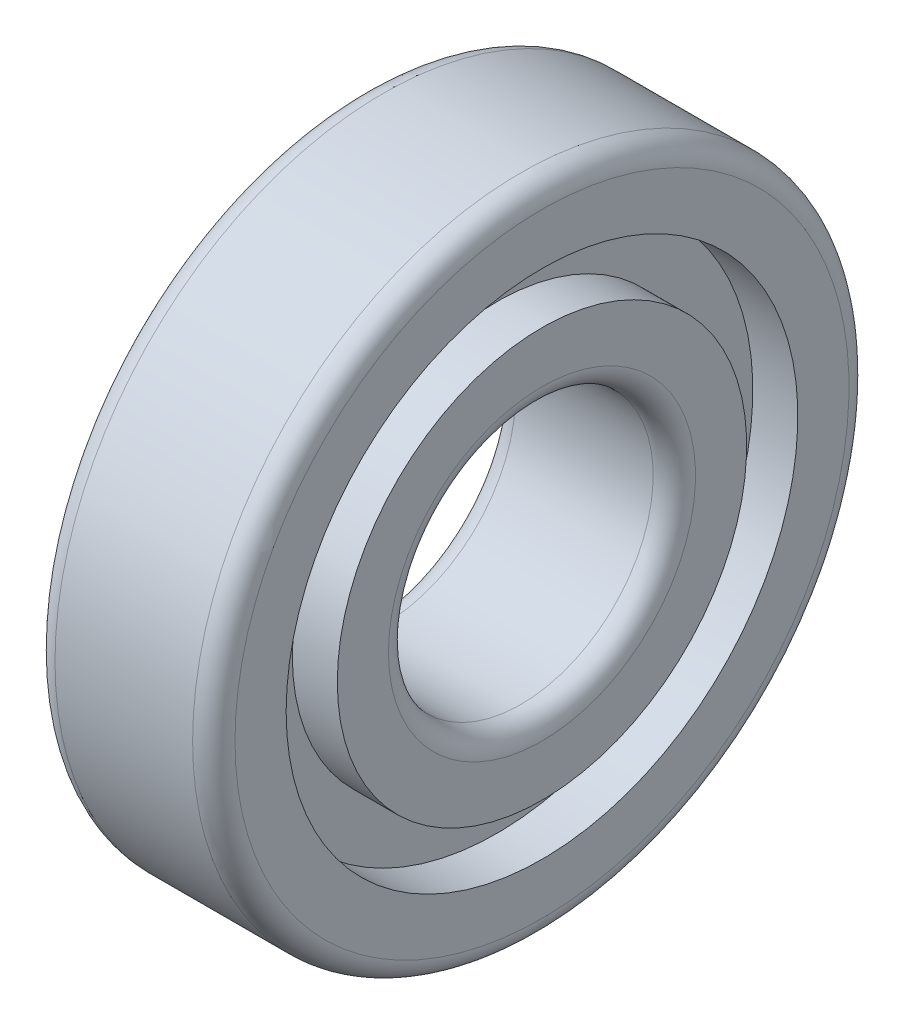
ISO-10303-21;
HEADER;
FILE_DESCRIPTION(('STEP AP214'),'2;1');
FILE_NAME('part.step','',(''),(''),'','','');
FILE_SCHEMA(('AUTOMOTIVE_DESIGN { 1 0 10303 214 1 1 1 1 }'));
ENDSEC;
DATA;
#1=APPLICATION_CONTEXT('core data for automotive mechanical design processes');
#2=APPLICATION_PROTOCOL_DEFINITION('international standard','automotive_design',2000,#1);
#3=PRODUCT_CONTEXT('',#1,'mechanical');
#4=PRODUCT('Part','Part','',(#3));
#5=PRODUCT_RELATED_PRODUCT_CATEGORY('part','',(#4));
#6=PRODUCT_DEFINITION_FORMATION('','',#4);
#7=PRODUCT_DEFINITION_CONTEXT('part definition',#1,'design');
#8=PRODUCT_DEFINITION('design','',#6,#7);
#9=PRODUCT_DEFINITION_SHAPE('','',#8);
#10=(LENGTH_UNIT() NAMED_UNIT(*) SI_UNIT(.MILLI.,.METRE.));
#11=(NAMED_UNIT(*) PLANE_ANGLE_UNIT() SI_UNIT($,.RADIAN.));
#12=(NAMED_UNIT(*) SI_UNIT($,.STERADIAN.) SOLID_ANGLE_UNIT());
#13=UNCERTAINTY_MEASURE_WITH_UNIT(LENGTH_MEASURE(1.E-05),#10,'distance_accuracy_value','');
#14=(GEOMETRIC_REPRESENTATION_CONTEXT(3) GLOBAL_UNCERTAINTY_ASSIGNED_CONTEXT((#13)) GLOBAL_UNIT_ASSIGNED_CONTEXT((#10,
#11,#12)) REPRESENTATION_CONTEXT('',''));
#15=CARTESIAN_POINT('',(0.,0.,0.));
#16=DIRECTION('',(0.,0.,1.));
#17=DIRECTION('',(1.,0.,0.));
#18=AXIS2_PLACEMENT_3D('',#15,#16,#17);
#19=CARTESIAN_POINT('',(-873.991742101089,0.,0.));
#20=DIRECTION('',(-1.,0.,0.));
#21=DIRECTION('',(0.,0.,1.));
#22=AXIS2_PLACEMENT_3D('',#19,#20,#21);
#23=CYLINDRICAL_SURFACE('',#22,19.3333333333333);
#24=CARTESIAN_POINT('',(-8.49999999999995,0.,0.));
#25=DIRECTION('',(-1.,0.,0.));
#26=DIRECTION('',(0.,0.,1.));
#27=AXIS2_PLACEMENT_3D('',#24,#25,#26);
#28=CIRCLE('',#27,19.3333333333333);
#29=CARTESIAN_POINT('',(-8.49999999999995,0.,19.3333333333333));
#30=VERTEX_POINT('',#29);
#31=EDGE_CURVE('E104',#30,#30,#28,.T.);
#32=ORIENTED_EDGE('',*,*,#31,.F.);
#33=EDGE_LOOP('',(#32));
#34=FACE_BOUND('',#33,.T.);
#35=CARTESIAN_POINT('',(-4.24999999999998,0.,0.));
#36=DIRECTION('',(-1.,0.,0.));
#37=DIRECTION('',(0.,0.,1.));
#38=AXIS2_PLACEMENT_3D('',#35,#36,#37);
#39=CIRCLE('',#38,19.3333333333333);
#40=CARTESIAN_POINT('',(-4.24999999999998,0.,19.3333333333333));
#41=VERTEX_POINT('',#40);
#42=EDGE_CURVE('E10',#41,#41,#39,.T.);
#43=ORIENTED_EDGE('',*,*,#42,.T.);
#44=EDGE_LOOP('',(#43));
#45=FACE_BOUND('',#44,.T.);
#46=ADVANCED_FACE('F37',(#34,#45),#23,.T.);
#47=CARTESIAN_POINT('',(-4.25,19.3333333333333,0.));
#48=DIRECTION('',(1.,0.,0.));
#49=DIRECTION('',(0.,0.,-1.));
#50=AXIS2_PLACEMENT_3D('',#47,#48,#49);
#51=PLANE('',#50);
#52=ORIENTED_EDGE('',*,*,#42,.F.);
#53=EDGE_LOOP('',(#52));
#54=FACE_BOUND('',#53,.T.);
#55=CARTESIAN_POINT('',(-4.24999999999998,0.,0.));
#56=DIRECTION('',(-1.,0.,0.));
#57=DIRECTION('',(0.,0.,1.));
#58=AXIS2_PLACEMENT_3D('',#55,#56,#57);
#59=CIRCLE('',#58,24.1666666666667);
#60=CARTESIAN_POINT('',(-4.24999999999998,0.,24.1666666666667));
#61=VERTEX_POINT('',#60);
#62=EDGE_CURVE('E44',#61,#61,#59,.T.);
#63=ORIENTED_EDGE('',*,*,#62,.T.);
#64=EDGE_LOOP('',(#63));
#65=FACE_BOUND('',#64,.T.);
#66=ADVANCED_FACE('F112',(#54,#65),#51,.F.);
#67=CARTESIAN_POINT('',(-873.991742101089,0.,0.));
#68=DIRECTION('',(-1.,0.,0.));
#69=DIRECTION('',(0.,0.,1.));
#70=AXIS2_PLACEMENT_3D('',#67,#68,#69);
#71=CYLINDRICAL_SURFACE('',#70,24.1666666666667);
#72=ORIENTED_EDGE('',*,*,#62,.F.);
#73=EDGE_LOOP('',(#72));
#74=FACE_BOUND('',#73,.T.);
#75=CARTESIAN_POINT('',(-8.49999999999995,0.,0.));
#76=DIRECTION('',(-1.,0.,0.));
#77=DIRECTION('',(0.,0.,1.));
#78=AXIS2_PLACEMENT_3D('',#75,#76,#77);
#79=CIRCLE('',#78,24.1666666666667);
#80=CARTESIAN_POINT('',(-8.49999999999995,0.,24.1666666666667));
#81=VERTEX_POINT('',#80);
#82=EDGE_CURVE('E49',#81,#81,#79,.T.);
#83=ORIENTED_EDGE('',*,*,#82,.T.);
#84=EDGE_LOOP('',(#83));
#85=FACE_BOUND('',#84,.T.);
#86=ADVANCED_FACE('F116',(#74,#85),#71,.F.);
#87=CARTESIAN_POINT('',(-8.5,24.1666666666667,0.));
#88=DIRECTION('',(1.,0.,0.));
#89=DIRECTION('',(0.,0.,-1.));
#90=AXIS2_PLACEMENT_3D('',#87,#88,#89);
#91=PLANE('',#90);
#92=ORIENTED_EDGE('',*,*,#82,.F.);
#93=EDGE_LOOP('',(#92));
#94=FACE_BOUND('',#93,.T.);
#95=CARTESIAN_POINT('',(-8.49999999999995,0.,0.));
#96=DIRECTION('',(-1.,0.,0.));
#97=DIRECTION('',(0.,0.,1.));
#98=AXIS2_PLACEMENT_3D('',#95,#96,#97);
#99=CIRCLE('',#98,29.);
#100=CARTESIAN_POINT('',(-8.49999999999995,0.,29.));
#101=VERTEX_POINT('',#100);
#102=EDGE_CURVE('E54',#101,#101,#99,.T.);
#103=ORIENTED_EDGE('',*,*,#102,.T.);
#104=EDGE_LOOP('',(#103));
#105=FACE_BOUND('',#104,.T.);
#106=ADVANCED_FACE('F121',(#94,#105),#91,.F.);
#107=CARTESIAN_POINT('',(-6.5,0.,0.));
#108=DIRECTION('',(-1.,0.,0.));
#109=DIRECTION('',(0.,0.,1.));
#110=AXIS2_PLACEMENT_3D('',#107,#108,#109);
#111=TOROIDAL_SURFACE('',#110,29.,2.);
#112=ORIENTED_EDGE('',*,*,#102,.F.);
#113=EDGE_LOOP('',(#112));
#114=FACE_BOUND('',#113,.T.);
#115=CARTESIAN_POINT('',(-6.49999999999995,0.,0.));
#116=DIRECTION('',(-1.,0.,0.));
#117=DIRECTION('',(0.,0.,1.));
#118=AXIS2_PLACEMENT_3D('',#115,#116,#117);
#119=CIRCLE('',#118,31.);
#120=CARTESIAN_POINT('',(-6.49999999999995,0.,31.));
#121=VERTEX_POINT('',#120);
#122=EDGE_CURVE('E60',#121,#121,#119,.T.);
#123=ORIENTED_EDGE('',*,*,#122,.T.);
#124=EDGE_LOOP('',(#123));
#125=FACE_BOUND('',#124,.T.);
#126=ADVANCED_FACE('F127',(#114,#125),#111,.T.);
#127=CARTESIAN_POINT('',(-873.991742101089,0.,0.));
#128=DIRECTION('',(-1.,0.,0.));
#129=DIRECTION('',(0.,0.,1.));
#130=AXIS2_PLACEMENT_3D('',#127,#128,#129);
#131=CYLINDRICAL_SURFACE('',#130,31.);
#132=ORIENTED_EDGE('',*,*,#122,.F.);
#133=EDGE_LOOP('',(#132));
#134=FACE_BOUND('',#133,.T.);
#135=CARTESIAN_POINT('',(6.49999999999973,0.,0.));
#136=DIRECTION('',(-1.,0.,0.));
#137=DIRECTION('',(0.,0.,1.));
#138=AXIS2_PLACEMENT_3D('',#135,#136,#137);
#139=CIRCLE('',#138,31.);
#140=CARTESIAN_POINT('',(6.49999999999973,0.,31.));
#141=VERTEX_POINT('',#140);
#142=EDGE_CURVE('E64',#141,#141,#139,.T.);
#143=ORIENTED_EDGE('',*,*,#142,.T.);
#144=EDGE_LOOP('',(#143));
#145=FACE_BOUND('',#144,.T.);
#146=ADVANCED_FACE('F131',(#134,#145),#131,.T.);
#147=CARTESIAN_POINT('',(6.4999999999998,0.,0.));
#148=DIRECTION('',(-1.,0.,0.));
#149=DIRECTION('',(0.,0.,1.));
#150=AXIS2_PLACEMENT_3D('',#147,#148,#149);
#151=TOROIDAL_SURFACE('',#150,29.,2.);
#152=ORIENTED_EDGE('',*,*,#142,.F.);
#153=EDGE_LOOP('',(#152));
#154=FACE_BOUND('',#153,.T.);
#155=CARTESIAN_POINT('',(8.49999999999984,0.,0.));
#156=DIRECTION('',(-1.,0.,0.));
#157=DIRECTION('',(0.,0.,1.));
#158=AXIS2_PLACEMENT_3D('',#155,#156,#157);
#159=CIRCLE('',#158,29.);
#160=CARTESIAN_POINT('',(8.49999999999984,0.,29.));
#161=VERTEX_POINT('',#160);
#162=EDGE_CURVE('E68',#161,#161,#159,.T.);
#163=ORIENTED_EDGE('',*,*,#162,.T.);
#164=EDGE_LOOP('',(#163));
#165=FACE_BOUND('',#164,.T.);
#166=ADVANCED_FACE('F135',(#154,#165),#151,.T.);
#167=CARTESIAN_POINT('',(8.49999999999982,24.1666666666667,0.));
#168=DIRECTION('',(-1.,0.,0.));
#169=DIRECTION('',(0.,0.,1.));
#170=AXIS2_PLACEMENT_3D('',#167,#168,#169);
#171=PLANE('',#170);
#172=ORIENTED_EDGE('',*,*,#162,.F.);
#173=EDGE_LOOP('',(#172));
#174=FACE_BOUND('',#173,.T.);
#175=CARTESIAN_POINT('',(8.49999999999984,0.,0.));
#176=DIRECTION('',(-1.,0.,0.));
#177=DIRECTION('',(0.,0.,1.));
#178=AXIS2_PLACEMENT_3D('',#175,#176,#177);
#179=CIRCLE('',#178,24.1666666666667);
#180=CARTESIAN_POINT('',(8.49999999999984,0.,24.1666666666667));
#181=VERTEX_POINT('',#180);
#182=EDGE_CURVE('E72',#181,#181,#179,.T.);
#183=ORIENTED_EDGE('',*,*,#182,.T.);
#184=EDGE_LOOP('',(#183));
#185=FACE_BOUND('',#184,.T.);
#186=ADVANCED_FACE('F139',(#174,#185),#171,.F.);
#187=CARTESIAN_POINT('',(-873.991742101089,0.,0.));
#188=DIRECTION('',(-1.,0.,0.));
#189=DIRECTION('',(0.,0.,1.));
#190=AXIS2_PLACEMENT_3D('',#187,#188,#189);
#191=CYLINDRICAL_SURFACE('',#190,24.1666666666667);
#192=ORIENTED_EDGE('',*,*,#182,.F.);
#193=EDGE_LOOP('',(#192));
#194=FACE_BOUND('',#193,.T.);
#195=CARTESIAN_POINT('',(4.24999999999986,0.,0.));
#196=DIRECTION('',(-1.,0.,0.));
#197=DIRECTION('',(0.,0.,1.));
#198=AXIS2_PLACEMENT_3D('',#195,#196,#197);
#199=CIRCLE('',#198,24.1666666666667);
#200=CARTESIAN_POINT('',(4.24999999999986,0.,24.1666666666667));
#201=VERTEX_POINT('',#200);
#202=EDGE_CURVE('E76',#201,#201,#199,.T.);
#203=ORIENTED_EDGE('',*,*,#202,.T.);
#204=EDGE_LOOP('',(#203));
#205=FACE_BOUND('',#204,.T.);
#206=ADVANCED_FACE('F143',(#194,#205),#191,.F.);
#207=CARTESIAN_POINT('',(4.24999999999985,19.3333333333333,0.));
#208=DIRECTION('',(-1.,0.,0.));
#209=DIRECTION('',(0.,0.,1.));
#210=AXIS2_PLACEMENT_3D('',#207,#208,#209);
#211=PLANE('',#210);
#212=ORIENTED_EDGE('',*,*,#202,.F.);
#213=EDGE_LOOP('',(#212));
#214=FACE_BOUND('',#213,.T.);
#215=CARTESIAN_POINT('',(4.24999999999986,0.,0.));
#216=DIRECTION('',(-1.,0.,0.));
#217=DIRECTION('',(0.,0.,1.));
#218=AXIS2_PLACEMENT_3D('',#215,#216,#217);
#219=CIRCLE('',#218,19.3333333333333);
#220=CARTESIAN_POINT('',(4.24999999999986,0.,19.3333333333333));
#221=VERTEX_POINT('',#220);
#222=EDGE_CURVE('E80',#221,#221,#219,.T.);
#223=ORIENTED_EDGE('',*,*,#222,.T.);
#224=EDGE_LOOP('',(#223));
#225=FACE_BOUND('',#224,.T.);
#226=ADVANCED_FACE('F147',(#214,#225),#211,.F.);
#227=CARTESIAN_POINT('',(-873.991742101089,0.,0.));
#228=DIRECTION('',(-1.,0.,0.));
#229=DIRECTION('',(0.,0.,1.));
#230=AXIS2_PLACEMENT_3D('',#227,#228,#229);
#231=CYLINDRICAL_SURFACE('',#230,19.3333333333333);
#232=ORIENTED_EDGE('',*,*,#222,.F.);
#233=EDGE_LOOP('',(#232));
#234=FACE_BOUND('',#233,.T.);
#235=CARTESIAN_POINT('',(8.49999999999984,0.,0.));
#236=DIRECTION('',(-1.,0.,0.));
#237=DIRECTION('',(0.,0.,1.));
#238=AXIS2_PLACEMENT_3D('',#235,#236,#237);
#239=CIRCLE('',#238,19.3333333333333);
#240=CARTESIAN_POINT('',(8.49999999999984,0.,19.3333333333333));
#241=VERTEX_POINT('',#240);
#242=EDGE_CURVE('E84',#241,#241,#239,.T.);
#243=ORIENTED_EDGE('',*,*,#242,.T.);
#244=EDGE_LOOP('',(#243));
#245=FACE_BOUND('',#244,.T.);
#246=ADVANCED_FACE('F151',(#234,#245),#231,.T.);
#247=CARTESIAN_POINT('',(8.49999999999988,14.5,0.));
#248=DIRECTION('',(-1.,0.,0.));
#249=DIRECTION('',(0.,0.,1.));
#250=AXIS2_PLACEMENT_3D('',#247,#248,#249);
#251=PLANE('',#250);
#252=ORIENTED_EDGE('',*,*,#242,.F.);
#253=EDGE_LOOP('',(#252));
#254=FACE_BOUND('',#253,.T.);
#255=CARTESIAN_POINT('',(8.49999999999995,0.,0.));
#256=DIRECTION('',(-1.,0.,0.));
#257=DIRECTION('',(0.,0.,1.));
#258=AXIS2_PLACEMENT_3D('',#255,#256,#257);
#259=CIRCLE('',#258,14.5);
#260=CARTESIAN_POINT('',(8.49999999999995,0.,14.5));
#261=VERTEX_POINT('',#260);
#262=EDGE_CURVE('E88',#261,#261,#259,.T.);
#263=ORIENTED_EDGE('',*,*,#262,.T.);
#264=EDGE_LOOP('',(#263));
#265=FACE_BOUND('',#264,.T.);
#266=ADVANCED_FACE('F155',(#254,#265),#251,.F.);
#267=CARTESIAN_POINT('',(6.4999999999999,0.,0.));
#268=DIRECTION('',(-1.,0.,0.));
#269=DIRECTION('',(0.,0.,1.));
#270=AXIS2_PLACEMENT_3D('',#267,#268,#269);
#271=TOROIDAL_SURFACE('',#270,14.5,2.);
#272=ORIENTED_EDGE('',*,*,#262,.F.);
#273=EDGE_LOOP('',(#272));
#274=FACE_BOUND('',#273,.T.);
#275=CARTESIAN_POINT('',(6.49999999999995,0.,0.));
#276=DIRECTION('',(-1.,0.,0.));
#277=DIRECTION('',(0.,0.,1.));
#278=AXIS2_PLACEMENT_3D('',#275,#276,#277);
#279=CIRCLE('',#278,12.5);
#280=CARTESIAN_POINT('',(6.49999999999995,0.,12.5));
#281=VERTEX_POINT('',#280);
#282=EDGE_CURVE('E92',#281,#281,#279,.T.);
#283=ORIENTED_EDGE('',*,*,#282,.T.);
#284=EDGE_LOOP('',(#283));
#285=FACE_BOUND('',#284,.T.);
#286=ADVANCED_FACE('F159',(#274,#285),#271,.T.);
#287=CARTESIAN_POINT('',(-873.991742101089,0.,0.));
#288=DIRECTION('',(-1.,0.,0.));
#289=DIRECTION('',(0.,0.,1.));
#290=AXIS2_PLACEMENT_3D('',#287,#288,#289);
#291=CYLINDRICAL_SURFACE('',#290,12.5);
#292=ORIENTED_EDGE('',*,*,#282,.F.);
#293=EDGE_LOOP('',(#292));
#294=FACE_BOUND('',#293,.T.);
#295=CARTESIAN_POINT('',(-6.49999999999995,0.,0.));
#296=DIRECTION('',(-1.,0.,0.));
#297=DIRECTION('',(0.,0.,1.));
#298=AXIS2_PLACEMENT_3D('',#295,#296,#297);
#299=CIRCLE('',#298,12.5);
#300=CARTESIAN_POINT('',(-6.49999999999995,0.,12.5));
#301=VERTEX_POINT('',#300);
#302=EDGE_CURVE('E96',#301,#301,#299,.T.);
#303=ORIENTED_EDGE('',*,*,#302,.T.);
#304=EDGE_LOOP('',(#303));
#305=FACE_BOUND('',#304,.T.);
#306=ADVANCED_FACE('F163',(#294,#305),#291,.F.);
#307=CARTESIAN_POINT('',(-6.5,0.,0.));
#308=DIRECTION('',(-1.,0.,0.));
#309=DIRECTION('',(0.,0.,1.));
#310=AXIS2_PLACEMENT_3D('',#307,#308,#309);
#311=TOROIDAL_SURFACE('',#310,14.5,2.);
#312=ORIENTED_EDGE('',*,*,#302,.F.);
#313=EDGE_LOOP('',(#312));
#314=FACE_BOUND('',#313,.T.);
#315=CARTESIAN_POINT('',(-8.49999999999995,0.,0.));
#316=DIRECTION('',(-1.,0.,0.));
#317=DIRECTION('',(0.,0.,1.));
#318=AXIS2_PLACEMENT_3D('',#315,#316,#317);
#319=CIRCLE('',#318,14.5);
#320=CARTESIAN_POINT('',(-8.49999999999995,0.,14.5));
#321=VERTEX_POINT('',#320);
#322=EDGE_CURVE('E100',#321,#321,#319,.T.);
#323=ORIENTED_EDGE('',*,*,#322,.T.);
#324=EDGE_LOOP('',(#323));
#325=FACE_BOUND('',#324,.T.);
#326=ADVANCED_FACE('F167',(#314,#325),#311,.T.);
#327=CARTESIAN_POINT('',(-8.5,14.5,0.));
#328=DIRECTION('',(1.,0.,0.));
#329=DIRECTION('',(0.,0.,-1.));
#330=AXIS2_PLACEMENT_3D('',#327,#328,#329);
#331=PLANE('',#330);
#332=ORIENTED_EDGE('',*,*,#322,.F.);
#333=EDGE_LOOP('',(#332));
#334=FACE_BOUND('',#333,.T.);
#335=ORIENTED_EDGE('',*,*,#31,.T.);
#336=EDGE_LOOP('',(#335));
#337=FACE_BOUND('',#336,.T.);
#338=ADVANCED_FACE('F109',(#334,#337),#331,.F.);
#339=CLOSED_SHELL('',(#46,#66,#86,#106,#126,#146,#166,#186,#206,#226,#246,#266,#286,#306,#326,#338));
#340=MANIFOLD_SOLID_BREP('B2',#339);
#341=ADVANCED_BREP_SHAPE_REPRESENTATION('',(#18,#340),#14);
#342=SHAPE_DEFINITION_REPRESENTATION(#9,#341);
ENDSEC;
END-ISO-10303-21;
